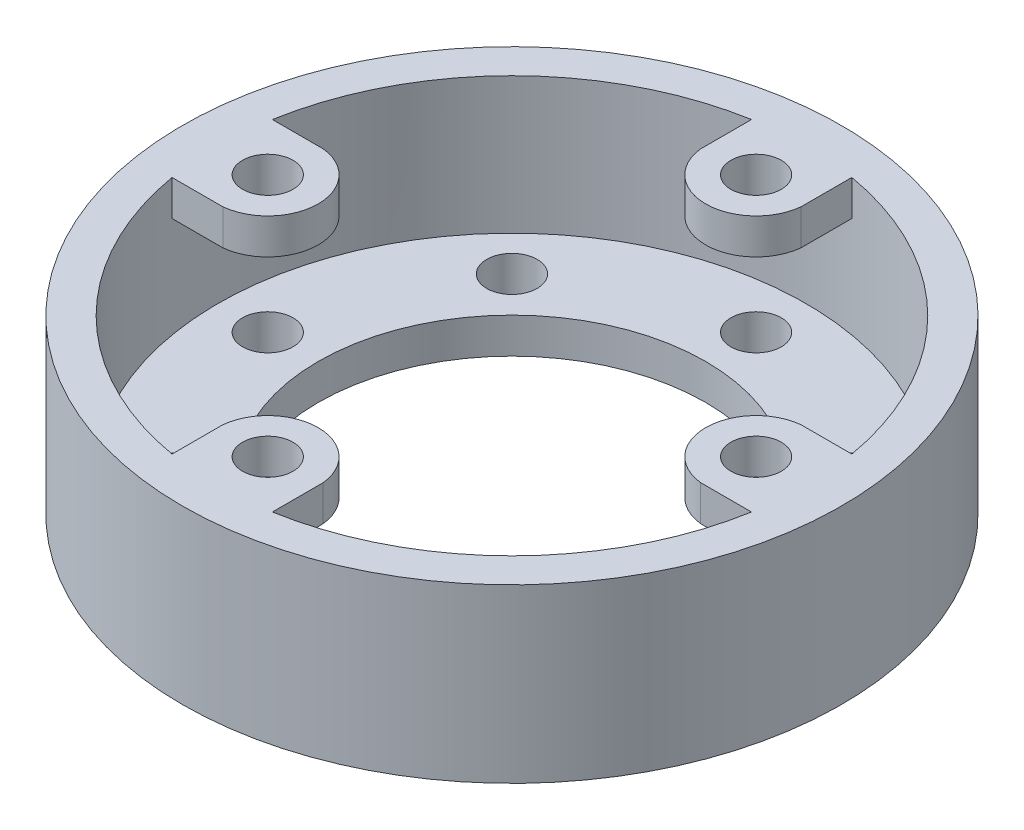
ISO-10303-21;
HEADER;
FILE_DESCRIPTION(('STEP AP214'),'2;1');
FILE_NAME('part.step','',(''),(''),'','','');
FILE_SCHEMA(('AUTOMOTIVE_DESIGN { 1 0 10303 214 1 1 1 1 }'));
ENDSEC;
DATA;
#1=APPLICATION_CONTEXT('core data for automotive mechanical design processes');
#2=APPLICATION_PROTOCOL_DEFINITION('international standard','automotive_design',2000,#1);
#3=PRODUCT_CONTEXT('',#1,'mechanical');
#4=PRODUCT('Part','Part','',(#3));
#5=PRODUCT_RELATED_PRODUCT_CATEGORY('part','',(#4));
#6=PRODUCT_DEFINITION_FORMATION('','',#4);
#7=PRODUCT_DEFINITION_CONTEXT('part definition',#1,'design');
#8=PRODUCT_DEFINITION('design','',#6,#7);
#9=PRODUCT_DEFINITION_SHAPE('','',#8);
#10=(LENGTH_UNIT() NAMED_UNIT(*) SI_UNIT(.MILLI.,.METRE.));
#11=(NAMED_UNIT(*) PLANE_ANGLE_UNIT() SI_UNIT($,.RADIAN.));
#12=(NAMED_UNIT(*) SI_UNIT($,.STERADIAN.) SOLID_ANGLE_UNIT());
#13=UNCERTAINTY_MEASURE_WITH_UNIT(LENGTH_MEASURE(1.E-05),#10,'distance_accuracy_value','');
#14=(GEOMETRIC_REPRESENTATION_CONTEXT(3) GLOBAL_UNCERTAINTY_ASSIGNED_CONTEXT((#13)) GLOBAL_UNIT_ASSIGNED_CONTEXT((#10,
#11,#12)) REPRESENTATION_CONTEXT('',''));
#15=CARTESIAN_POINT('',(0.,0.,0.));
#16=DIRECTION('',(0.,0.,1.));
#17=DIRECTION('',(1.,0.,0.));
#18=AXIS2_PLACEMENT_3D('',#15,#16,#17);
#19=CARTESIAN_POINT('',(0.,15.,0.));
#20=DIRECTION('',(0.,-1.,0.));
#21=DIRECTION('',(0.,0.,-1.));
#22=AXIS2_PLACEMENT_3D('',#19,#20,#21);
#23=CYLINDRICAL_SURFACE('',#22,25.65);
#24=CARTESIAN_POINT('',(0.,3.1,0.));
#25=DIRECTION('',(0.,1.,0.));
#26=DIRECTION('',(0.,0.,1.));
#27=AXIS2_PLACEMENT_3D('',#24,#25,#26);
#28=CIRCLE('',#27,25.65);
#29=CARTESIAN_POINT('',(0.,3.1,25.65));
#30=VERTEX_POINT('',#29);
#31=EDGE_CURVE('E384',#30,#30,#28,.F.);
#32=ORIENTED_EDGE('',*,*,#31,.T.);
#33=EDGE_LOOP('',(#32));
#34=FACE_BOUND('',#33,.T.);
#35=CARTESIAN_POINT('',(0.,15.,0.));
#36=DIRECTION('',(0.,1.,0.));
#37=DIRECTION('',(0.,0.,1.));
#38=AXIS2_PLACEMENT_3D('',#35,#36,#37);
#39=CIRCLE('',#38,25.65);
#40=CARTESIAN_POINT('',(-4.37646729943861,15.,-25.2738804693095));
#41=VERTEX_POINT('',#40);
#42=CARTESIAN_POINT('',(-25.2738804693095,15.,-4.3764672994386));
#43=VERTEX_POINT('',#42);
#44=EDGE_CURVE('E241',#41,#43,#39,.T.);
#45=ORIENTED_EDGE('',*,*,#44,.T.);
#46=DIRECTION('',(0.,-1.,0.));
#47=VECTOR('',#46,1.);
#48=CARTESIAN_POINT('',(-25.2738804693095,15.,-4.3764672994386));
#49=LINE('',#48,#47);
#50=CARTESIAN_POINT('',(-25.2738804693095,11.9,-4.3764672994386));
#51=VERTEX_POINT('',#50);
#52=EDGE_CURVE('E137',#43,#51,#49,.T.);
#53=ORIENTED_EDGE('',*,*,#52,.T.);
#54=CARTESIAN_POINT('',(0.,11.9,0.));
#55=DIRECTION('',(0.,1.,0.));
#56=DIRECTION('',(0.,0.,1.));
#57=AXIS2_PLACEMENT_3D('',#54,#55,#56);
#58=CIRCLE('',#57,25.65);
#59=CARTESIAN_POINT('',(-25.2738804693095,11.9,4.3764672994386));
#60=VERTEX_POINT('',#59);
#61=EDGE_CURVE('E132',#51,#60,#58,.T.);
#62=ORIENTED_EDGE('',*,*,#61,.T.);
#63=DIRECTION('',(0.,-1.,0.));
#64=VECTOR('',#63,1.);
#65=CARTESIAN_POINT('',(-25.2738804693095,15.,4.3764672994386));
#66=LINE('',#65,#64);
#67=CARTESIAN_POINT('',(-25.2738804693095,15.,4.3764672994386));
#68=VERTEX_POINT('',#67);
#69=EDGE_CURVE('E245',#68,#60,#66,.T.);
#70=ORIENTED_EDGE('',*,*,#69,.F.);
#71=CARTESIAN_POINT('',(-4.37646729943859,15.,25.2738804693095));
#72=VERTEX_POINT('',#71);
#73=EDGE_CURVE('E229',#68,#72,#39,.T.);
#74=ORIENTED_EDGE('',*,*,#73,.T.);
#75=DIRECTION('',(0.,-1.,0.));
#76=VECTOR('',#75,1.);
#77=CARTESIAN_POINT('',(-4.37646729943859,15.,25.2738804693095));
#78=LINE('',#77,#76);
#79=CARTESIAN_POINT('',(-4.37646729943859,11.9,25.2738804693095));
#80=VERTEX_POINT('',#79);
#81=EDGE_CURVE('E308',#72,#80,#78,.T.);
#82=ORIENTED_EDGE('',*,*,#81,.T.);
#83=CARTESIAN_POINT('',(0.,11.9,0.));
#84=DIRECTION('',(0.,1.,0.));
#85=DIRECTION('',(0.,0.,1.));
#86=AXIS2_PLACEMENT_3D('',#83,#84,#85);
#87=CIRCLE('',#86,25.65);
#88=CARTESIAN_POINT('',(4.37646729943861,11.9,25.2738804693095));
#89=VERTEX_POINT('',#88);
#90=EDGE_CURVE('E295',#80,#89,#87,.T.);
#91=ORIENTED_EDGE('',*,*,#90,.T.);
#92=DIRECTION('',(0.,-1.,0.));
#93=VECTOR('',#92,1.);
#94=CARTESIAN_POINT('',(4.37646729943861,15.,25.2738804693095));
#95=LINE('',#94,#93);
#96=CARTESIAN_POINT('',(4.37646729943861,15.,25.2738804693095));
#97=VERTEX_POINT('',#96);
#98=EDGE_CURVE('E305',#97,#89,#95,.T.);
#99=ORIENTED_EDGE('',*,*,#98,.F.);
#100=CARTESIAN_POINT('',(25.2738804693095,15.,4.37646729943859));
#101=VERTEX_POINT('',#100);
#102=EDGE_CURVE('E242',#97,#101,#39,.T.);
#103=ORIENTED_EDGE('',*,*,#102,.T.);
#104=DIRECTION('',(0.,-1.,0.));
#105=VECTOR('',#104,1.);
#106=CARTESIAN_POINT('',(25.2738804693095,15.,4.37646729943859));
#107=LINE('',#106,#105);
#108=CARTESIAN_POINT('',(25.2738804693095,11.9,4.37646729943859));
#109=VERTEX_POINT('',#108);
#110=EDGE_CURVE('E377',#101,#109,#107,.T.);
#111=ORIENTED_EDGE('',*,*,#110,.T.);
#112=CARTESIAN_POINT('',(0.,11.9,0.));
#113=DIRECTION('',(0.,1.,0.));
#114=DIRECTION('',(0.,0.,1.));
#115=AXIS2_PLACEMENT_3D('',#112,#113,#114);
#116=CIRCLE('',#115,25.65);
#117=CARTESIAN_POINT('',(25.2738804693095,11.9,-4.37646729943861));
#118=VERTEX_POINT('',#117);
#119=EDGE_CURVE('E364',#109,#118,#116,.T.);
#120=ORIENTED_EDGE('',*,*,#119,.T.);
#121=DIRECTION('',(0.,-1.,0.));
#122=VECTOR('',#121,1.);
#123=CARTESIAN_POINT('',(25.2738804693095,15.,-4.37646729943861));
#124=LINE('',#123,#122);
#125=CARTESIAN_POINT('',(25.2738804693095,15.,-4.37646729943861));
#126=VERTEX_POINT('',#125);
#127=EDGE_CURVE('E374',#126,#118,#124,.T.);
#128=ORIENTED_EDGE('',*,*,#127,.F.);
#129=CARTESIAN_POINT('',(4.37646729943859,15.,-25.2738804693095));
#130=VERTEX_POINT('',#129);
#131=EDGE_CURVE('E244',#126,#130,#39,.T.);
#132=ORIENTED_EDGE('',*,*,#131,.T.);
#133=DIRECTION('',(0.,-1.,0.));
#134=VECTOR('',#133,1.);
#135=CARTESIAN_POINT('',(4.37646729943859,15.,-25.2738804693095));
#136=LINE('',#135,#134);
#137=CARTESIAN_POINT('',(4.37646729943859,11.9,-25.2738804693095));
#138=VERTEX_POINT('',#137);
#139=EDGE_CURVE('E343',#130,#138,#136,.T.);
#140=ORIENTED_EDGE('',*,*,#139,.T.);
#141=CARTESIAN_POINT('',(0.,11.9,0.));
#142=DIRECTION('',(0.,1.,0.));
#143=DIRECTION('',(0.,0.,1.));
#144=AXIS2_PLACEMENT_3D('',#141,#142,#143);
#145=CIRCLE('',#144,25.65);
#146=CARTESIAN_POINT('',(-4.37646729943861,11.9,-25.2738804693095));
#147=VERTEX_POINT('',#146);
#148=EDGE_CURVE('E330',#138,#147,#145,.T.);
#149=ORIENTED_EDGE('',*,*,#148,.T.);
#150=DIRECTION('',(0.,-1.,0.));
#151=VECTOR('',#150,1.);
#152=CARTESIAN_POINT('',(-4.37646729943861,15.,-25.2738804693095));
#153=LINE('',#152,#151);
#154=EDGE_CURVE('E340',#41,#147,#153,.T.);
#155=ORIENTED_EDGE('',*,*,#154,.F.);
#156=EDGE_LOOP('',(#45,#53,#62,#70,#74,#82,#91,#99,#103,#111,#120,#128,#132,#140,#149,#155));
#157=FACE_BOUND('',#156,.T.);
#158=ADVANCED_FACE('F117',(#34,#157),#23,.F.);
#159=CARTESIAN_POINT('',(0.,3.1,0.));
#160=DIRECTION('',(0.,1.,0.));
#161=DIRECTION('',(0.,0.,1.));
#162=AXIS2_PLACEMENT_3D('',#159,#160,#161);
#163=PLANE('',#162);
#164=CARTESIAN_POINT('',(-15.0613744392735,3.1,-15.0613744392735));
#165=DIRECTION('',(0.,1.,0.));
#166=DIRECTION('',(0.,0.,1.));
#167=AXIS2_PLACEMENT_3D('',#164,#165,#166);
#168=CIRCLE('',#167,2.2);
#169=CARTESIAN_POINT('',(-15.0613744392735,3.1,-12.8613744392735));
#170=VERTEX_POINT('',#169);
#171=EDGE_CURVE('E396',#170,#170,#168,.T.);
#172=ORIENTED_EDGE('',*,*,#171,.F.);
#173=EDGE_LOOP('',(#172));
#174=FACE_BOUND('',#173,.T.);
#175=CARTESIAN_POINT('',(15.0613744392735,3.1,-15.0613744392735));
#176=DIRECTION('',(0.,1.,0.));
#177=DIRECTION('',(0.,0.,1.));
#178=AXIS2_PLACEMENT_3D('',#175,#176,#177);
#179=CIRCLE('',#178,2.2);
#180=CARTESIAN_POINT('',(15.0613744392735,3.1,-12.8613744392735));
#181=VERTEX_POINT('',#180);
#182=EDGE_CURVE('E408',#181,#181,#179,.T.);
#183=ORIENTED_EDGE('',*,*,#182,.F.);
#184=EDGE_LOOP('',(#183));
#185=FACE_BOUND('',#184,.T.);
#186=CARTESIAN_POINT('',(15.0613744392735,3.1,15.0613744392735));
#187=DIRECTION('',(0.,1.,0.));
#188=DIRECTION('',(0.,0.,1.));
#189=AXIS2_PLACEMENT_3D('',#186,#187,#188);
#190=CIRCLE('',#189,2.2);
#191=CARTESIAN_POINT('',(15.0613744392735,3.1,17.2613744392735));
#192=VERTEX_POINT('',#191);
#193=EDGE_CURVE('E420',#192,#192,#190,.T.);
#194=ORIENTED_EDGE('',*,*,#193,.F.);
#195=EDGE_LOOP('',(#194));
#196=FACE_BOUND('',#195,.T.);
#197=CARTESIAN_POINT('',(-15.0613744392735,3.1,15.0613744392735));
#198=DIRECTION('',(0.,1.,0.));
#199=DIRECTION('',(0.,0.,1.));
#200=AXIS2_PLACEMENT_3D('',#197,#198,#199);
#201=CIRCLE('',#200,2.2);
#202=CARTESIAN_POINT('',(-15.0613744392735,3.1,17.2613744392735));
#203=VERTEX_POINT('',#202);
#204=EDGE_CURVE('E432',#203,#203,#201,.T.);
#205=ORIENTED_EDGE('',*,*,#204,.F.);
#206=EDGE_LOOP('',(#205));
#207=FACE_BOUND('',#206,.T.);
#208=ORIENTED_EDGE('',*,*,#31,.F.);
#209=EDGE_LOOP('',(#208));
#210=FACE_BOUND('',#209,.T.);
#211=CARTESIAN_POINT('',(0.,3.1,0.));
#212=DIRECTION('',(0.,1.,0.));
#213=DIRECTION('',(0.,0.,1.));
#214=AXIS2_PLACEMENT_3D('',#211,#212,#213);
#215=CIRCLE('',#214,16.9);
#216=CARTESIAN_POINT('',(0.,3.1,16.9));
#217=VERTEX_POINT('',#216);
#218=EDGE_CURVE('E12',#217,#217,#215,.T.);
#219=ORIENTED_EDGE('',*,*,#218,.F.);
#220=EDGE_LOOP('',(#219));
#221=FACE_BOUND('',#220,.T.);
#222=CARTESIAN_POINT('',(0.,3.1,21.3));
#223=DIRECTION('',(0.,1.,0.));
#224=DIRECTION('',(0.,0.,1.));
#225=AXIS2_PLACEMENT_3D('',#222,#223,#224);
#226=CIRCLE('',#225,2.2);
#227=CARTESIAN_POINT('',(0.,3.1,23.5));
#228=VERTEX_POINT('',#227);
#229=EDGE_CURVE('E426',#228,#228,#226,.T.);
#230=ORIENTED_EDGE('',*,*,#229,.F.);
#231=EDGE_LOOP('',(#230));
#232=FACE_BOUND('',#231,.T.);
#233=CARTESIAN_POINT('',(21.3,3.1,0.));
#234=DIRECTION('',(0.,1.,0.));
#235=DIRECTION('',(0.,0.,1.));
#236=AXIS2_PLACEMENT_3D('',#233,#234,#235);
#237=CIRCLE('',#236,2.2);
#238=CARTESIAN_POINT('',(21.3,3.1,2.2));
#239=VERTEX_POINT('',#238);
#240=EDGE_CURVE('E414',#239,#239,#237,.T.);
#241=ORIENTED_EDGE('',*,*,#240,.F.);
#242=EDGE_LOOP('',(#241));
#243=FACE_BOUND('',#242,.T.);
#244=CARTESIAN_POINT('',(0.,3.1,-21.3));
#245=DIRECTION('',(0.,1.,0.));
#246=DIRECTION('',(0.,0.,1.));
#247=AXIS2_PLACEMENT_3D('',#244,#245,#246);
#248=CIRCLE('',#247,2.2);
#249=CARTESIAN_POINT('',(0.,3.1,-19.1));
#250=VERTEX_POINT('',#249);
#251=EDGE_CURVE('E402',#250,#250,#248,.T.);
#252=ORIENTED_EDGE('',*,*,#251,.F.);
#253=EDGE_LOOP('',(#252));
#254=FACE_BOUND('',#253,.T.);
#255=CARTESIAN_POINT('',(-21.3,3.1,0.));
#256=DIRECTION('',(0.,1.,0.));
#257=DIRECTION('',(0.,0.,1.));
#258=AXIS2_PLACEMENT_3D('',#255,#256,#257);
#259=CIRCLE('',#258,2.2);
#260=CARTESIAN_POINT('',(-21.3,3.1,2.20000000000001));
#261=VERTEX_POINT('',#260);
#262=EDGE_CURVE('E390',#261,#261,#259,.T.);
#263=ORIENTED_EDGE('',*,*,#262,.F.);
#264=EDGE_LOOP('',(#263));
#265=FACE_BOUND('',#264,.T.);
#266=ADVANCED_FACE('F456',(#174,#185,#196,#207,#210,#221,#232,#243,#254,#265),#163,.T.);
#267=CARTESIAN_POINT('',(0.,0.,0.));
#268=DIRECTION('',(0.,1.,0.));
#269=DIRECTION('',(0.,0.,1.));
#270=AXIS2_PLACEMENT_3D('',#267,#268,#269);
#271=PLANE('',#270);
#272=CARTESIAN_POINT('',(0.,0.,0.));
#273=DIRECTION('',(0.,1.,0.));
#274=DIRECTION('',(0.,0.,1.));
#275=AXIS2_PLACEMENT_3D('',#272,#273,#274);
#276=CIRCLE('',#275,16.9);
#277=CARTESIAN_POINT('',(0.,0.,16.9));
#278=VERTEX_POINT('',#277);
#279=EDGE_CURVE('E121',#278,#278,#276,.T.);
#280=ORIENTED_EDGE('',*,*,#279,.T.);
#281=EDGE_LOOP('',(#280));
#282=FACE_BOUND('',#281,.T.);
#283=CARTESIAN_POINT('',(-15.0613744392735,0.,15.0613744392735));
#284=DIRECTION('',(0.,1.,0.));
#285=DIRECTION('',(0.,0.,1.));
#286=AXIS2_PLACEMENT_3D('',#283,#284,#285);
#287=CIRCLE('',#286,2.2);
#288=CARTESIAN_POINT('',(-15.0613744392735,0.,17.2613744392735));
#289=VERTEX_POINT('',#288);
#290=EDGE_CURVE('E429',#289,#289,#287,.T.);
#291=ORIENTED_EDGE('',*,*,#290,.T.);
#292=EDGE_LOOP('',(#291));
#293=FACE_BOUND('',#292,.T.);
#294=CARTESIAN_POINT('',(0.,0.,21.3));
#295=DIRECTION('',(0.,1.,0.));
#296=DIRECTION('',(0.,0.,1.));
#297=AXIS2_PLACEMENT_3D('',#294,#295,#296);
#298=CIRCLE('',#297,2.2);
#299=CARTESIAN_POINT('',(0.,0.,23.5));
#300=VERTEX_POINT('',#299);
#301=EDGE_CURVE('E423',#300,#300,#298,.T.);
#302=ORIENTED_EDGE('',*,*,#301,.T.);
#303=EDGE_LOOP('',(#302));
#304=FACE_BOUND('',#303,.T.);
#305=CARTESIAN_POINT('',(15.0613744392735,0.,15.0613744392735));
#306=DIRECTION('',(0.,1.,0.));
#307=DIRECTION('',(0.,0.,1.));
#308=AXIS2_PLACEMENT_3D('',#305,#306,#307);
#309=CIRCLE('',#308,2.2);
#310=CARTESIAN_POINT('',(15.0613744392735,0.,17.2613744392735));
#311=VERTEX_POINT('',#310);
#312=EDGE_CURVE('E417',#311,#311,#309,.T.);
#313=ORIENTED_EDGE('',*,*,#312,.T.);
#314=EDGE_LOOP('',(#313));
#315=FACE_BOUND('',#314,.T.);
#316=CARTESIAN_POINT('',(21.3,0.,0.));
#317=DIRECTION('',(0.,1.,0.));
#318=DIRECTION('',(0.,0.,1.));
#319=AXIS2_PLACEMENT_3D('',#316,#317,#318);
#320=CIRCLE('',#319,2.2);
#321=CARTESIAN_POINT('',(21.3,0.,2.2));
#322=VERTEX_POINT('',#321);
#323=EDGE_CURVE('E411',#322,#322,#320,.T.);
#324=ORIENTED_EDGE('',*,*,#323,.T.);
#325=EDGE_LOOP('',(#324));
#326=FACE_BOUND('',#325,.T.);
#327=CARTESIAN_POINT('',(15.0613744392735,0.,-15.0613744392735));
#328=DIRECTION('',(0.,1.,0.));
#329=DIRECTION('',(0.,0.,1.));
#330=AXIS2_PLACEMENT_3D('',#327,#328,#329);
#331=CIRCLE('',#330,2.2);
#332=CARTESIAN_POINT('',(15.0613744392735,0.,-12.8613744392735));
#333=VERTEX_POINT('',#332);
#334=EDGE_CURVE('E405',#333,#333,#331,.T.);
#335=ORIENTED_EDGE('',*,*,#334,.T.);
#336=EDGE_LOOP('',(#335));
#337=FACE_BOUND('',#336,.T.);
#338=CARTESIAN_POINT('',(0.,0.,-21.3));
#339=DIRECTION('',(0.,1.,0.));
#340=DIRECTION('',(0.,0.,1.));
#341=AXIS2_PLACEMENT_3D('',#338,#339,#340);
#342=CIRCLE('',#341,2.2);
#343=CARTESIAN_POINT('',(0.,0.,-19.1));
#344=VERTEX_POINT('',#343);
#345=EDGE_CURVE('E399',#344,#344,#342,.T.);
#346=ORIENTED_EDGE('',*,*,#345,.T.);
#347=EDGE_LOOP('',(#346));
#348=FACE_BOUND('',#347,.T.);
#349=CARTESIAN_POINT('',(-15.0613744392735,0.,-15.0613744392735));
#350=DIRECTION('',(0.,1.,0.));
#351=DIRECTION('',(0.,0.,1.));
#352=AXIS2_PLACEMENT_3D('',#349,#350,#351);
#353=CIRCLE('',#352,2.2);
#354=CARTESIAN_POINT('',(-15.0613744392735,0.,-12.8613744392735));
#355=VERTEX_POINT('',#354);
#356=EDGE_CURVE('E393',#355,#355,#353,.T.);
#357=ORIENTED_EDGE('',*,*,#356,.T.);
#358=EDGE_LOOP('',(#357));
#359=FACE_BOUND('',#358,.T.);
#360=CARTESIAN_POINT('',(-21.3,0.,0.));
#361=DIRECTION('',(0.,1.,0.));
#362=DIRECTION('',(0.,0.,1.));
#363=AXIS2_PLACEMENT_3D('',#360,#361,#362);
#364=CIRCLE('',#363,2.2);
#365=CARTESIAN_POINT('',(-21.3,0.,2.20000000000001));
#366=VERTEX_POINT('',#365);
#367=EDGE_CURVE('E389',#366,#366,#364,.T.);
#368=ORIENTED_EDGE('',*,*,#367,.T.);
#369=EDGE_LOOP('',(#368));
#370=FACE_BOUND('',#369,.T.);
#371=CARTESIAN_POINT('',(0.,0.,0.));
#372=DIRECTION('',(0.,1.,0.));
#373=DIRECTION('',(0.,0.,1.));
#374=AXIS2_PLACEMENT_3D('',#371,#372,#373);
#375=CIRCLE('',#374,28.75);
#376=CARTESIAN_POINT('',(0.,0.,28.75));
#377=VERTEX_POINT('',#376);
#378=EDGE_CURVE('E380',#377,#377,#375,.T.);
#379=ORIENTED_EDGE('',*,*,#378,.F.);
#380=EDGE_LOOP('',(#379));
#381=FACE_BOUND('',#380,.T.);
#382=ADVANCED_FACE('F119',(#282,#293,#304,#315,#326,#337,#348,#359,#370,#381),#271,.F.);
#383=CARTESIAN_POINT('',(0.,3.1,0.));
#384=DIRECTION('',(0.,-1.,0.));
#385=DIRECTION('',(0.,0.,-1.));
#386=AXIS2_PLACEMENT_3D('',#383,#384,#385);
#387=CYLINDRICAL_SURFACE('',#386,16.9);
#388=ORIENTED_EDGE('',*,*,#218,.T.);
#389=EDGE_LOOP('',(#388));
#390=FACE_BOUND('',#389,.T.);
#391=ORIENTED_EDGE('',*,*,#279,.F.);
#392=EDGE_LOOP('',(#391));
#393=FACE_BOUND('',#392,.T.);
#394=ADVANCED_FACE('F443',(#390,#393),#387,.F.);
#395=CARTESIAN_POINT('',(-15.0613744392735,3.1,15.0613744392735));
#396=DIRECTION('',(0.,-1.,0.));
#397=DIRECTION('',(0.,0.,-1.));
#398=AXIS2_PLACEMENT_3D('',#395,#396,#397);
#399=CYLINDRICAL_SURFACE('',#398,2.2);
#400=ORIENTED_EDGE('',*,*,#204,.T.);
#401=EDGE_LOOP('',(#400));
#402=FACE_BOUND('',#401,.T.);
#403=ORIENTED_EDGE('',*,*,#290,.F.);
#404=EDGE_LOOP('',(#403));
#405=FACE_BOUND('',#404,.T.);
#406=ADVANCED_FACE('F440',(#402,#405),#399,.F.);
#407=CARTESIAN_POINT('',(0.,3.1,21.3));
#408=DIRECTION('',(0.,-1.,0.));
#409=DIRECTION('',(0.,0.,-1.));
#410=AXIS2_PLACEMENT_3D('',#407,#408,#409);
#411=CYLINDRICAL_SURFACE('',#410,2.2);
#412=ORIENTED_EDGE('',*,*,#229,.T.);
#413=EDGE_LOOP('',(#412));
#414=FACE_BOUND('',#413,.T.);
#415=ORIENTED_EDGE('',*,*,#301,.F.);
#416=EDGE_LOOP('',(#415));
#417=FACE_BOUND('',#416,.T.);
#418=ADVANCED_FACE('F442',(#414,#417),#411,.F.);
#419=CARTESIAN_POINT('',(15.0613744392735,3.1,15.0613744392735));
#420=DIRECTION('',(0.,-1.,0.));
#421=DIRECTION('',(0.,0.,-1.));
#422=AXIS2_PLACEMENT_3D('',#419,#420,#421);
#423=CYLINDRICAL_SURFACE('',#422,2.2);
#424=ORIENTED_EDGE('',*,*,#193,.T.);
#425=EDGE_LOOP('',(#424));
#426=FACE_BOUND('',#425,.T.);
#427=ORIENTED_EDGE('',*,*,#312,.F.);
#428=EDGE_LOOP('',(#427));
#429=FACE_BOUND('',#428,.T.);
#430=ADVANCED_FACE('F450',(#426,#429),#423,.F.);
#431=CARTESIAN_POINT('',(21.3,3.1,0.));
#432=DIRECTION('',(0.,-1.,0.));
#433=DIRECTION('',(0.,0.,-1.));
#434=AXIS2_PLACEMENT_3D('',#431,#432,#433);
#435=CYLINDRICAL_SURFACE('',#434,2.2);
#436=ORIENTED_EDGE('',*,*,#240,.T.);
#437=EDGE_LOOP('',(#436));
#438=FACE_BOUND('',#437,.T.);
#439=ORIENTED_EDGE('',*,*,#323,.F.);
#440=EDGE_LOOP('',(#439));
#441=FACE_BOUND('',#440,.T.);
#442=ADVANCED_FACE('F490',(#438,#441),#435,.F.);
#443=CARTESIAN_POINT('',(15.0613744392735,3.1,-15.0613744392735));
#444=DIRECTION('',(0.,-1.,0.));
#445=DIRECTION('',(0.,0.,-1.));
#446=AXIS2_PLACEMENT_3D('',#443,#444,#445);
#447=CYLINDRICAL_SURFACE('',#446,2.2);
#448=ORIENTED_EDGE('',*,*,#182,.T.);
#449=EDGE_LOOP('',(#448));
#450=FACE_BOUND('',#449,.T.);
#451=ORIENTED_EDGE('',*,*,#334,.F.);
#452=EDGE_LOOP('',(#451));
#453=FACE_BOUND('',#452,.T.);
#454=ADVANCED_FACE('F486',(#450,#453),#447,.F.);
#455=CARTESIAN_POINT('',(0.,3.1,-21.3));
#456=DIRECTION('',(0.,-1.,0.));
#457=DIRECTION('',(0.,0.,-1.));
#458=AXIS2_PLACEMENT_3D('',#455,#456,#457);
#459=CYLINDRICAL_SURFACE('',#458,2.2);
#460=ORIENTED_EDGE('',*,*,#251,.T.);
#461=EDGE_LOOP('',(#460));
#462=FACE_BOUND('',#461,.T.);
#463=ORIENTED_EDGE('',*,*,#345,.F.);
#464=EDGE_LOOP('',(#463));
#465=FACE_BOUND('',#464,.T.);
#466=ADVANCED_FACE('F482',(#462,#465),#459,.F.);
#467=CARTESIAN_POINT('',(-15.0613744392735,3.1,-15.0613744392735));
#468=DIRECTION('',(0.,-1.,0.));
#469=DIRECTION('',(0.,0.,-1.));
#470=AXIS2_PLACEMENT_3D('',#467,#468,#469);
#471=CYLINDRICAL_SURFACE('',#470,2.2);
#472=ORIENTED_EDGE('',*,*,#171,.T.);
#473=EDGE_LOOP('',(#472));
#474=FACE_BOUND('',#473,.T.);
#475=ORIENTED_EDGE('',*,*,#356,.F.);
#476=EDGE_LOOP('',(#475));
#477=FACE_BOUND('',#476,.T.);
#478=ADVANCED_FACE('F478',(#474,#477),#471,.F.);
#479=CARTESIAN_POINT('',(-21.3,3.1,0.));
#480=DIRECTION('',(0.,-1.,0.));
#481=DIRECTION('',(0.,0.,-1.));
#482=AXIS2_PLACEMENT_3D('',#479,#480,#481);
#483=CYLINDRICAL_SURFACE('',#482,2.2);
#484=ORIENTED_EDGE('',*,*,#262,.T.);
#485=EDGE_LOOP('',(#484));
#486=FACE_BOUND('',#485,.T.);
#487=ORIENTED_EDGE('',*,*,#367,.F.);
#488=EDGE_LOOP('',(#487));
#489=FACE_BOUND('',#488,.T.);
#490=ADVANCED_FACE('F470',(#486,#489),#483,.F.);
#491=CARTESIAN_POINT('',(0.,15.,0.));
#492=DIRECTION('',(0.,1.,0.));
#493=DIRECTION('',(0.,0.,1.));
#494=AXIS2_PLACEMENT_3D('',#491,#492,#493);
#495=PLANE('',#494);
#496=CARTESIAN_POINT('',(0.,15.,0.));
#497=DIRECTION('',(0.,1.,0.));
#498=DIRECTION('',(0.,0.,1.));
#499=AXIS2_PLACEMENT_3D('',#496,#497,#498);
#500=CIRCLE('',#499,28.75);
#501=CARTESIAN_POINT('',(0.,15.,28.75));
#502=VERTEX_POINT('',#501);
#503=EDGE_CURVE('E381',#502,#502,#500,.T.);
#504=ORIENTED_EDGE('',*,*,#503,.T.);
#505=EDGE_LOOP('',(#504));
#506=FACE_BOUND('',#505,.T.);
#507=ORIENTED_EDGE('',*,*,#131,.F.);
#508=DIRECTION('',(1.,0.,0.));
#509=VECTOR('',#508,1.);
#510=CARTESIAN_POINT('',(0.,15.,-4.3764672994386));
#511=LINE('',#510,#509);
#512=CARTESIAN_POINT('',(20.8455399061033,15.,-4.37646729943861));
#513=VERTEX_POINT('',#512);
#514=EDGE_CURVE('E353',#513,#126,#511,.T.);
#515=ORIENTED_EDGE('',*,*,#514,.F.);
#516=CARTESIAN_POINT('',(21.3,15.,0.));
#517=DIRECTION('',(0.,1.,0.));
#518=DIRECTION('',(0.,0.,1.));
#519=AXIS2_PLACEMENT_3D('',#516,#517,#518);
#520=CIRCLE('',#519,4.4);
#521=CARTESIAN_POINT('',(20.8455399061033,15.,4.37646729943859));
#522=VERTEX_POINT('',#521);
#523=EDGE_CURVE('E355',#522,#513,#520,.F.);
#524=ORIENTED_EDGE('',*,*,#523,.F.);
#525=DIRECTION('',(1.,0.,0.));
#526=VECTOR('',#525,1.);
#527=CARTESIAN_POINT('',(0.,15.,4.3764672994386));
#528=LINE('',#527,#526);
#529=EDGE_CURVE('E349',#522,#101,#528,.T.);
#530=ORIENTED_EDGE('',*,*,#529,.T.);
#531=ORIENTED_EDGE('',*,*,#102,.F.);
#532=DIRECTION('',(0.,0.,1.));
#533=VECTOR('',#532,1.);
#534=CARTESIAN_POINT('',(4.3764672994386,15.,0.));
#535=LINE('',#534,#533);
#536=CARTESIAN_POINT('',(4.37646729943861,15.,20.8455399061033));
#537=VERTEX_POINT('',#536);
#538=EDGE_CURVE('E283',#537,#97,#535,.T.);
#539=ORIENTED_EDGE('',*,*,#538,.F.);
#540=CARTESIAN_POINT('',(0.,15.,21.3));
#541=DIRECTION('',(0.,1.,0.));
#542=DIRECTION('',(0.,0.,1.));
#543=AXIS2_PLACEMENT_3D('',#540,#541,#542);
#544=CIRCLE('',#543,4.4);
#545=CARTESIAN_POINT('',(-4.37646729943859,15.,20.8455399061033));
#546=VERTEX_POINT('',#545);
#547=EDGE_CURVE('E286',#546,#537,#544,.F.);
#548=ORIENTED_EDGE('',*,*,#547,.F.);
#549=DIRECTION('',(0.,0.,1.));
#550=VECTOR('',#549,1.);
#551=CARTESIAN_POINT('',(-4.3764672994386,15.,0.));
#552=LINE('',#551,#550);
#553=EDGE_CURVE('E239',#546,#72,#552,.T.);
#554=ORIENTED_EDGE('',*,*,#553,.T.);
#555=ORIENTED_EDGE('',*,*,#73,.F.);
#556=DIRECTION('',(-1.,0.,0.));
#557=VECTOR('',#556,1.);
#558=CARTESIAN_POINT('',(0.,15.,4.3764672994386));
#559=LINE('',#558,#557);
#560=CARTESIAN_POINT('',(-20.8455399061033,15.,4.3764672994386));
#561=VERTEX_POINT('',#560);
#562=EDGE_CURVE('E235',#561,#68,#559,.T.);
#563=ORIENTED_EDGE('',*,*,#562,.F.);
#564=CARTESIAN_POINT('',(-21.3,15.,0.));
#565=DIRECTION('',(0.,1.,0.));
#566=DIRECTION('',(0.,0.,1.));
#567=AXIS2_PLACEMENT_3D('',#564,#565,#566);
#568=CIRCLE('',#567,4.4);
#569=CARTESIAN_POINT('',(-20.8455399061033,15.,-4.3764672994386));
#570=VERTEX_POINT('',#569);
#571=EDGE_CURVE('E252',#570,#561,#568,.F.);
#572=ORIENTED_EDGE('',*,*,#571,.F.);
#573=DIRECTION('',(-1.,0.,0.));
#574=VECTOR('',#573,1.);
#575=CARTESIAN_POINT('',(0.,15.,-4.3764672994386));
#576=LINE('',#575,#574);
#577=EDGE_CURVE('E253',#570,#43,#576,.T.);
#578=ORIENTED_EDGE('',*,*,#577,.T.);
#579=ORIENTED_EDGE('',*,*,#44,.F.);
#580=DIRECTION('',(0.,0.,-1.));
#581=VECTOR('',#580,1.);
#582=CARTESIAN_POINT('',(-4.37646729943859,15.,0.));
#583=LINE('',#582,#581);
#584=CARTESIAN_POINT('',(-4.37646729943861,15.,-20.8455399061033));
#585=VERTEX_POINT('',#584);
#586=EDGE_CURVE('E318',#585,#41,#583,.T.);
#587=ORIENTED_EDGE('',*,*,#586,.F.);
#588=CARTESIAN_POINT('',(0.,15.,-21.3));
#589=DIRECTION('',(0.,1.,0.));
#590=DIRECTION('',(0.,0.,1.));
#591=AXIS2_PLACEMENT_3D('',#588,#589,#590);
#592=CIRCLE('',#591,4.4);
#593=CARTESIAN_POINT('',(4.37646729943859,15.,-20.8455399061033));
#594=VERTEX_POINT('',#593);
#595=EDGE_CURVE('E321',#594,#585,#592,.F.);
#596=ORIENTED_EDGE('',*,*,#595,.F.);
#597=DIRECTION('',(0.,0.,-1.));
#598=VECTOR('',#597,1.);
#599=CARTESIAN_POINT('',(4.37646729943861,15.,0.));
#600=LINE('',#599,#598);
#601=EDGE_CURVE('E314',#594,#130,#600,.T.);
#602=ORIENTED_EDGE('',*,*,#601,.T.);
#603=EDGE_LOOP('',(#507,#515,#524,#530,#531,#539,#548,#554,#555,#563,#572,#578,#579,#587,#596,#602));
#604=FACE_BOUND('',#603,.T.);
#605=CARTESIAN_POINT('',(21.3,15.,0.));
#606=DIRECTION('',(0.,1.,0.));
#607=DIRECTION('',(0.,0.,1.));
#608=AXIS2_PLACEMENT_3D('',#605,#606,#607);
#609=CIRCLE('',#608,2.20000000000005);
#610=CARTESIAN_POINT('',(21.3,15.,2.20000000000004));
#611=VERTEX_POINT('',#610);
#612=EDGE_CURVE('E346',#611,#611,#609,.T.);
#613=ORIENTED_EDGE('',*,*,#612,.F.);
#614=EDGE_LOOP('',(#613));
#615=FACE_BOUND('',#614,.T.);
#616=CARTESIAN_POINT('',(0.,15.,-21.3));
#617=DIRECTION('',(0.,1.,0.));
#618=DIRECTION('',(0.,0.,1.));
#619=AXIS2_PLACEMENT_3D('',#616,#617,#618);
#620=CIRCLE('',#619,2.20000000000003);
#621=CARTESIAN_POINT('',(0.,15.,-19.1));
#622=VERTEX_POINT('',#621);
#623=EDGE_CURVE('E311',#622,#622,#620,.T.);
#624=ORIENTED_EDGE('',*,*,#623,.F.);
#625=EDGE_LOOP('',(#624));
#626=FACE_BOUND('',#625,.T.);
#627=CARTESIAN_POINT('',(0.,15.,21.3));
#628=DIRECTION('',(0.,1.,0.));
#629=DIRECTION('',(0.,0.,1.));
#630=AXIS2_PLACEMENT_3D('',#627,#628,#629);
#631=CIRCLE('',#630,2.20000000000007);
#632=CARTESIAN_POINT('',(0.,15.,23.5000000000001));
#633=VERTEX_POINT('',#632);
#634=EDGE_CURVE('E278',#633,#633,#631,.T.);
#635=ORIENTED_EDGE('',*,*,#634,.F.);
#636=EDGE_LOOP('',(#635));
#637=FACE_BOUND('',#636,.T.);
#638=CARTESIAN_POINT('',(-21.3,15.,0.));
#639=DIRECTION('',(0.,1.,0.));
#640=DIRECTION('',(0.,0.,1.));
#641=AXIS2_PLACEMENT_3D('',#638,#639,#640);
#642=CIRCLE('',#641,2.2);
#643=CARTESIAN_POINT('',(-21.3,15.,2.20000000000001));
#644=VERTEX_POINT('',#643);
#645=EDGE_CURVE('E258',#644,#644,#642,.T.);
#646=ORIENTED_EDGE('',*,*,#645,.F.);
#647=EDGE_LOOP('',(#646));
#648=FACE_BOUND('',#647,.T.);
#649=ADVANCED_FACE('F231',(#506,#604,#615,#626,#637,#648),#495,.T.);
#650=CARTESIAN_POINT('',(0.,15.,0.));
#651=DIRECTION('',(0.,-1.,0.));
#652=DIRECTION('',(0.,0.,-1.));
#653=AXIS2_PLACEMENT_3D('',#650,#651,#652);
#654=CYLINDRICAL_SURFACE('',#653,28.75);
#655=ORIENTED_EDGE('',*,*,#503,.F.);
#656=EDGE_LOOP('',(#655));
#657=FACE_BOUND('',#656,.T.);
#658=ORIENTED_EDGE('',*,*,#378,.T.);
#659=EDGE_LOOP('',(#658));
#660=FACE_BOUND('',#659,.T.);
#661=ADVANCED_FACE('F469',(#657,#660),#654,.T.);
#662=CARTESIAN_POINT('',(0.,15.,4.3764672994386));
#663=DIRECTION('',(0.,0.,-1.));
#664=DIRECTION('',(-1.,0.,0.));
#665=AXIS2_PLACEMENT_3D('',#662,#663,#664);
#666=PLANE('',#665);
#667=DIRECTION('',(1.,0.,0.));
#668=VECTOR('',#667,1.);
#669=CARTESIAN_POINT('',(0.,11.9,4.3764672994386));
#670=LINE('',#669,#668);
#671=CARTESIAN_POINT('',(20.8455399061033,11.9,4.37646729943859));
#672=VERTEX_POINT('',#671);
#673=EDGE_CURVE('E361',#672,#109,#670,.T.);
#674=ORIENTED_EDGE('',*,*,#673,.T.);
#675=ORIENTED_EDGE('',*,*,#110,.F.);
#676=ORIENTED_EDGE('',*,*,#529,.F.);
#677=DIRECTION('',(0.,-1.,0.));
#678=VECTOR('',#677,1.);
#679=CARTESIAN_POINT('',(20.8455399061033,15.,4.37646729943859));
#680=LINE('',#679,#678);
#681=EDGE_CURVE('E358',#522,#672,#680,.T.);
#682=ORIENTED_EDGE('',*,*,#681,.T.);
#683=EDGE_LOOP('',(#674,#675,#676,#682));
#684=FACE_BOUND('',#683,.T.);
#685=ADVANCED_FACE('F474',(#684),#666,.F.);
#686=CARTESIAN_POINT('',(0.,15.,-4.3764672994386));
#687=DIRECTION('',(0.,0.,-1.));
#688=DIRECTION('',(-1.,0.,0.));
#689=AXIS2_PLACEMENT_3D('',#686,#687,#688);
#690=PLANE('',#689);
#691=DIRECTION('',(1.,0.,0.));
#692=VECTOR('',#691,1.);
#693=CARTESIAN_POINT('',(0.,11.9,-4.3764672994386));
#694=LINE('',#693,#692);
#695=CARTESIAN_POINT('',(20.8455399061033,11.9,-4.37646729943861));
#696=VERTEX_POINT('',#695);
#697=EDGE_CURVE('E367',#696,#118,#694,.T.);
#698=ORIENTED_EDGE('',*,*,#697,.F.);
#699=DIRECTION('',(0.,-1.,0.));
#700=VECTOR('',#699,1.);
#701=CARTESIAN_POINT('',(20.8455399061033,15.,-4.37646729943861));
#702=LINE('',#701,#700);
#703=EDGE_CURVE('E372',#513,#696,#702,.T.);
#704=ORIENTED_EDGE('',*,*,#703,.F.);
#705=ORIENTED_EDGE('',*,*,#514,.T.);
#706=ORIENTED_EDGE('',*,*,#127,.T.);
#707=EDGE_LOOP('',(#698,#704,#705,#706));
#708=FACE_BOUND('',#707,.T.);
#709=ADVANCED_FACE('F597',(#708),#690,.T.);
#710=CARTESIAN_POINT('',(21.3,15.,0.));
#711=DIRECTION('',(0.,-1.,0.));
#712=DIRECTION('',(0.,0.,-1.));
#713=AXIS2_PLACEMENT_3D('',#710,#711,#712);
#714=CYLINDRICAL_SURFACE('',#713,2.20000000000005);
#715=ORIENTED_EDGE('',*,*,#612,.T.);
#716=EDGE_LOOP('',(#715));
#717=FACE_BOUND('',#716,.T.);
#718=CARTESIAN_POINT('',(21.3,11.9,0.));
#719=DIRECTION('',(0.,1.,0.));
#720=DIRECTION('',(0.,0.,1.));
#721=AXIS2_PLACEMENT_3D('',#718,#719,#720);
#722=CIRCLE('',#721,2.20000000000005);
#723=CARTESIAN_POINT('',(21.3,11.9,2.20000000000004));
#724=VERTEX_POINT('',#723);
#725=EDGE_CURVE('E345',#724,#724,#722,.T.);
#726=ORIENTED_EDGE('',*,*,#725,.F.);
#727=EDGE_LOOP('',(#726));
#728=FACE_BOUND('',#727,.T.);
#729=ADVANCED_FACE('F465',(#717,#728),#714,.F.);
#730=CARTESIAN_POINT('',(21.3,15.,0.));
#731=DIRECTION('',(0.,-1.,0.));
#732=DIRECTION('',(0.,0.,-1.));
#733=AXIS2_PLACEMENT_3D('',#730,#731,#732);
#734=CYLINDRICAL_SURFACE('',#733,4.4);
#735=CARTESIAN_POINT('',(21.3,11.9,0.));
#736=DIRECTION('',(0.,1.,0.));
#737=DIRECTION('',(0.,0.,1.));
#738=AXIS2_PLACEMENT_3D('',#735,#736,#737);
#739=CIRCLE('',#738,4.4);
#740=EDGE_CURVE('E350',#672,#696,#739,.F.);
#741=ORIENTED_EDGE('',*,*,#740,.F.);
#742=ORIENTED_EDGE('',*,*,#681,.F.);
#743=ORIENTED_EDGE('',*,*,#523,.T.);
#744=ORIENTED_EDGE('',*,*,#703,.T.);
#745=EDGE_LOOP('',(#741,#742,#743,#744));
#746=FACE_BOUND('',#745,.T.);
#747=ADVANCED_FACE('F611',(#746),#734,.T.);
#748=CARTESIAN_POINT('',(0.,11.9,0.));
#749=DIRECTION('',(0.,1.,0.));
#750=DIRECTION('',(0.,0.,1.));
#751=AXIS2_PLACEMENT_3D('',#748,#749,#750);
#752=PLANE('',#751);
#753=ORIENTED_EDGE('',*,*,#725,.T.);
#754=EDGE_LOOP('',(#753));
#755=FACE_BOUND('',#754,.T.);
#756=ORIENTED_EDGE('',*,*,#673,.F.);
#757=ORIENTED_EDGE('',*,*,#740,.T.);
#758=ORIENTED_EDGE('',*,*,#697,.T.);
#759=ORIENTED_EDGE('',*,*,#119,.F.);
#760=EDGE_LOOP('',(#756,#757,#758,#759));
#761=FACE_BOUND('',#760,.T.);
#762=ADVANCED_FACE('F618',(#755,#761),#752,.F.);
#763=CARTESIAN_POINT('',(4.37646729943861,15.,0.));
#764=DIRECTION('',(-1.,0.,0.));
#765=DIRECTION('',(0.,0.,1.));
#766=AXIS2_PLACEMENT_3D('',#763,#764,#765);
#767=PLANE('',#766);
#768=DIRECTION('',(0.,0.,-1.));
#769=VECTOR('',#768,1.);
#770=CARTESIAN_POINT('',(4.37646729943861,11.9,0.));
#771=LINE('',#770,#769);
#772=CARTESIAN_POINT('',(4.37646729943859,11.9,-20.8455399061033));
#773=VERTEX_POINT('',#772);
#774=EDGE_CURVE('E327',#773,#138,#771,.T.);
#775=ORIENTED_EDGE('',*,*,#774,.T.);
#776=ORIENTED_EDGE('',*,*,#139,.F.);
#777=ORIENTED_EDGE('',*,*,#601,.F.);
#778=DIRECTION('',(0.,-1.,0.));
#779=VECTOR('',#778,1.);
#780=CARTESIAN_POINT('',(4.37646729943859,15.,-20.8455399061033));
#781=LINE('',#780,#779);
#782=EDGE_CURVE('E324',#594,#773,#781,.T.);
#783=ORIENTED_EDGE('',*,*,#782,.T.);
#784=EDGE_LOOP('',(#775,#776,#777,#783));
#785=FACE_BOUND('',#784,.T.);
#786=ADVANCED_FACE('F626',(#785),#767,.F.);
#787=CARTESIAN_POINT('',(-4.37646729943859,15.,0.));
#788=DIRECTION('',(-1.,0.,0.));
#789=DIRECTION('',(0.,0.,1.));
#790=AXIS2_PLACEMENT_3D('',#787,#788,#789);
#791=PLANE('',#790);
#792=DIRECTION('',(0.,0.,-1.));
#793=VECTOR('',#792,1.);
#794=CARTESIAN_POINT('',(-4.37646729943859,11.9,0.));
#795=LINE('',#794,#793);
#796=CARTESIAN_POINT('',(-4.37646729943861,11.9,-20.8455399061033));
#797=VERTEX_POINT('',#796);
#798=EDGE_CURVE('E332',#797,#147,#795,.T.);
#799=ORIENTED_EDGE('',*,*,#798,.F.);
#800=DIRECTION('',(0.,-1.,0.));
#801=VECTOR('',#800,1.);
#802=CARTESIAN_POINT('',(-4.37646729943861,15.,-20.8455399061033));
#803=LINE('',#802,#801);
#804=EDGE_CURVE('E338',#585,#797,#803,.T.);
#805=ORIENTED_EDGE('',*,*,#804,.F.);
#806=ORIENTED_EDGE('',*,*,#586,.T.);
#807=ORIENTED_EDGE('',*,*,#154,.T.);
#808=EDGE_LOOP('',(#799,#805,#806,#807));
#809=FACE_BOUND('',#808,.T.);
#810=ADVANCED_FACE('F634',(#809),#791,.T.);
#811=CARTESIAN_POINT('',(0.,15.,-21.3));
#812=DIRECTION('',(0.,-1.,0.));
#813=DIRECTION('',(0.,0.,-1.));
#814=AXIS2_PLACEMENT_3D('',#811,#812,#813);
#815=CYLINDRICAL_SURFACE('',#814,2.20000000000003);
#816=ORIENTED_EDGE('',*,*,#623,.T.);
#817=EDGE_LOOP('',(#816));
#818=FACE_BOUND('',#817,.T.);
#819=CARTESIAN_POINT('',(0.,11.9,-21.3));
#820=DIRECTION('',(0.,1.,0.));
#821=DIRECTION('',(0.,0.,1.));
#822=AXIS2_PLACEMENT_3D('',#819,#820,#821);
#823=CIRCLE('',#822,2.20000000000003);
#824=CARTESIAN_POINT('',(0.,11.9,-19.1));
#825=VERTEX_POINT('',#824);
#826=EDGE_CURVE('E310',#825,#825,#823,.T.);
#827=ORIENTED_EDGE('',*,*,#826,.F.);
#828=EDGE_LOOP('',(#827));
#829=FACE_BOUND('',#828,.T.);
#830=ADVANCED_FACE('F642',(#818,#829),#815,.F.);
#831=CARTESIAN_POINT('',(0.,15.,-21.3));
#832=DIRECTION('',(0.,-1.,0.));
#833=DIRECTION('',(0.,0.,-1.));
#834=AXIS2_PLACEMENT_3D('',#831,#832,#833);
#835=CYLINDRICAL_SURFACE('',#834,4.4);
#836=CARTESIAN_POINT('',(0.,11.9,-21.3));
#837=DIRECTION('',(0.,1.,0.));
#838=DIRECTION('',(0.,0.,1.));
#839=AXIS2_PLACEMENT_3D('',#836,#837,#838);
#840=CIRCLE('',#839,4.4);
#841=EDGE_CURVE('E315',#773,#797,#840,.F.);
#842=ORIENTED_EDGE('',*,*,#841,.F.);
#843=ORIENTED_EDGE('',*,*,#782,.F.);
#844=ORIENTED_EDGE('',*,*,#595,.T.);
#845=ORIENTED_EDGE('',*,*,#804,.T.);
#846=EDGE_LOOP('',(#842,#843,#844,#845));
#847=FACE_BOUND('',#846,.T.);
#848=ADVANCED_FACE('F650',(#847),#835,.T.);
#849=CARTESIAN_POINT('',(0.,11.9,0.));
#850=DIRECTION('',(0.,1.,0.));
#851=DIRECTION('',(0.,0.,1.));
#852=AXIS2_PLACEMENT_3D('',#849,#850,#851);
#853=PLANE('',#852);
#854=ORIENTED_EDGE('',*,*,#826,.T.);
#855=EDGE_LOOP('',(#854));
#856=FACE_BOUND('',#855,.T.);
#857=ORIENTED_EDGE('',*,*,#774,.F.);
#858=ORIENTED_EDGE('',*,*,#841,.T.);
#859=ORIENTED_EDGE('',*,*,#798,.T.);
#860=ORIENTED_EDGE('',*,*,#148,.F.);
#861=EDGE_LOOP('',(#857,#858,#859,#860));
#862=FACE_BOUND('',#861,.T.);
#863=ADVANCED_FACE('F658',(#856,#862),#853,.F.);
#864=CARTESIAN_POINT('',(-4.3764672994386,15.,0.));
#865=DIRECTION('',(1.,0.,0.));
#866=DIRECTION('',(0.,0.,-1.));
#867=AXIS2_PLACEMENT_3D('',#864,#865,#866);
#868=PLANE('',#867);
#869=DIRECTION('',(0.,0.,1.));
#870=VECTOR('',#869,1.);
#871=CARTESIAN_POINT('',(-4.3764672994386,11.9,0.));
#872=LINE('',#871,#870);
#873=CARTESIAN_POINT('',(-4.37646729943859,11.9,20.8455399061033));
#874=VERTEX_POINT('',#873);
#875=EDGE_CURVE('E292',#874,#80,#872,.T.);
#876=ORIENTED_EDGE('',*,*,#875,.T.);
#877=ORIENTED_EDGE('',*,*,#81,.F.);
#878=ORIENTED_EDGE('',*,*,#553,.F.);
#879=DIRECTION('',(0.,-1.,0.));
#880=VECTOR('',#879,1.);
#881=CARTESIAN_POINT('',(-4.37646729943859,15.,20.8455399061033));
#882=LINE('',#881,#880);
#883=EDGE_CURVE('E289',#546,#874,#882,.T.);
#884=ORIENTED_EDGE('',*,*,#883,.T.);
#885=EDGE_LOOP('',(#876,#877,#878,#884));
#886=FACE_BOUND('',#885,.T.);
#887=ADVANCED_FACE('F666',(#886),#868,.F.);
#888=CARTESIAN_POINT('',(4.3764672994386,15.,0.));
#889=DIRECTION('',(1.,0.,0.));
#890=DIRECTION('',(0.,0.,-1.));
#891=AXIS2_PLACEMENT_3D('',#888,#889,#890);
#892=PLANE('',#891);
#893=DIRECTION('',(0.,0.,1.));
#894=VECTOR('',#893,1.);
#895=CARTESIAN_POINT('',(4.3764672994386,11.9,0.));
#896=LINE('',#895,#894);
#897=CARTESIAN_POINT('',(4.37646729943861,11.9,20.8455399061033));
#898=VERTEX_POINT('',#897);
#899=EDGE_CURVE('E297',#898,#89,#896,.T.);
#900=ORIENTED_EDGE('',*,*,#899,.F.);
#901=DIRECTION('',(0.,-1.,0.));
#902=VECTOR('',#901,1.);
#903=CARTESIAN_POINT('',(4.37646729943861,15.,20.8455399061033));
#904=LINE('',#903,#902);
#905=EDGE_CURVE('E303',#537,#898,#904,.T.);
#906=ORIENTED_EDGE('',*,*,#905,.F.);
#907=ORIENTED_EDGE('',*,*,#538,.T.);
#908=ORIENTED_EDGE('',*,*,#98,.T.);
#909=EDGE_LOOP('',(#900,#906,#907,#908));
#910=FACE_BOUND('',#909,.T.);
#911=ADVANCED_FACE('F674',(#910),#892,.T.);
#912=CARTESIAN_POINT('',(0.,15.,21.3));
#913=DIRECTION('',(0.,-1.,0.));
#914=DIRECTION('',(0.,0.,-1.));
#915=AXIS2_PLACEMENT_3D('',#912,#913,#914);
#916=CYLINDRICAL_SURFACE('',#915,2.20000000000007);
#917=ORIENTED_EDGE('',*,*,#634,.T.);
#918=EDGE_LOOP('',(#917));
#919=FACE_BOUND('',#918,.T.);
#920=CARTESIAN_POINT('',(0.,11.9,21.3));
#921=DIRECTION('',(0.,1.,0.));
#922=DIRECTION('',(0.,0.,1.));
#923=AXIS2_PLACEMENT_3D('',#920,#921,#922);
#924=CIRCLE('',#923,2.20000000000007);
#925=CARTESIAN_POINT('',(0.,11.9,23.5000000000001));
#926=VERTEX_POINT('',#925);
#927=EDGE_CURVE('E277',#926,#926,#924,.T.);
#928=ORIENTED_EDGE('',*,*,#927,.F.);
#929=EDGE_LOOP('',(#928));
#930=FACE_BOUND('',#929,.T.);
#931=ADVANCED_FACE('F682',(#919,#930),#916,.F.);
#932=CARTESIAN_POINT('',(0.,15.,21.3));
#933=DIRECTION('',(0.,-1.,0.));
#934=DIRECTION('',(0.,0.,-1.));
#935=AXIS2_PLACEMENT_3D('',#932,#933,#934);
#936=CYLINDRICAL_SURFACE('',#935,4.4);
#937=CARTESIAN_POINT('',(0.,11.9,21.3));
#938=DIRECTION('',(0.,1.,0.));
#939=DIRECTION('',(0.,0.,1.));
#940=AXIS2_PLACEMENT_3D('',#937,#938,#939);
#941=CIRCLE('',#940,4.4);
#942=EDGE_CURVE('E281',#874,#898,#941,.F.);
#943=ORIENTED_EDGE('',*,*,#942,.F.);
#944=ORIENTED_EDGE('',*,*,#883,.F.);
#945=ORIENTED_EDGE('',*,*,#547,.T.);
#946=ORIENTED_EDGE('',*,*,#905,.T.);
#947=EDGE_LOOP('',(#943,#944,#945,#946));
#948=FACE_BOUND('',#947,.T.);
#949=ADVANCED_FACE('F690',(#948),#936,.T.);
#950=CARTESIAN_POINT('',(0.,11.9,0.));
#951=DIRECTION('',(0.,1.,0.));
#952=DIRECTION('',(0.,0.,1.));
#953=AXIS2_PLACEMENT_3D('',#950,#951,#952);
#954=PLANE('',#953);
#955=ORIENTED_EDGE('',*,*,#927,.T.);
#956=EDGE_LOOP('',(#955));
#957=FACE_BOUND('',#956,.T.);
#958=ORIENTED_EDGE('',*,*,#875,.F.);
#959=ORIENTED_EDGE('',*,*,#942,.T.);
#960=ORIENTED_EDGE('',*,*,#899,.T.);
#961=ORIENTED_EDGE('',*,*,#90,.F.);
#962=EDGE_LOOP('',(#958,#959,#960,#961));
#963=FACE_BOUND('',#962,.T.);
#964=ADVANCED_FACE('F698',(#957,#963),#954,.F.);
#965=CARTESIAN_POINT('',(0.,15.,-4.3764672994386));
#966=DIRECTION('',(0.,0.,1.));
#967=DIRECTION('',(1.,0.,0.));
#968=AXIS2_PLACEMENT_3D('',#965,#966,#967);
#969=PLANE('',#968);
#970=DIRECTION('',(-1.,0.,0.));
#971=VECTOR('',#970,1.);
#972=CARTESIAN_POINT('',(0.,11.9,-4.3764672994386));
#973=LINE('',#972,#971);
#974=CARTESIAN_POINT('',(-20.8455399061033,11.9,-4.3764672994386));
#975=VERTEX_POINT('',#974);
#976=EDGE_CURVE('E265',#975,#51,#973,.T.);
#977=ORIENTED_EDGE('',*,*,#976,.T.);
#978=ORIENTED_EDGE('',*,*,#52,.F.);
#979=ORIENTED_EDGE('',*,*,#577,.F.);
#980=DIRECTION('',(0.,-1.,0.));
#981=VECTOR('',#980,1.);
#982=CARTESIAN_POINT('',(-20.8455399061033,15.,-4.3764672994386));
#983=LINE('',#982,#981);
#984=EDGE_CURVE('E255',#570,#975,#983,.T.);
#985=ORIENTED_EDGE('',*,*,#984,.T.);
#986=EDGE_LOOP('',(#977,#978,#979,#985));
#987=FACE_BOUND('',#986,.T.);
#988=ADVANCED_FACE('F706',(#987),#969,.F.);
#989=CARTESIAN_POINT('',(0.,15.,4.3764672994386));
#990=DIRECTION('',(0.,0.,1.));
#991=DIRECTION('',(1.,0.,0.));
#992=AXIS2_PLACEMENT_3D('',#989,#990,#991);
#993=PLANE('',#992);
#994=DIRECTION('',(-1.,0.,0.));
#995=VECTOR('',#994,1.);
#996=CARTESIAN_POINT('',(0.,11.9,4.3764672994386));
#997=LINE('',#996,#995);
#998=CARTESIAN_POINT('',(-20.8455399061033,11.9,4.3764672994386));
#999=VERTEX_POINT('',#998);
#1000=EDGE_CURVE('E269',#999,#60,#997,.T.);
#1001=ORIENTED_EDGE('',*,*,#1000,.F.);
#1002=DIRECTION('',(0.,-1.,0.));
#1003=VECTOR('',#1002,1.);
#1004=CARTESIAN_POINT('',(-20.8455399061033,15.,4.3764672994386));
#1005=LINE('',#1004,#1003);
#1006=EDGE_CURVE('E249',#561,#999,#1005,.T.);
#1007=ORIENTED_EDGE('',*,*,#1006,.F.);
#1008=ORIENTED_EDGE('',*,*,#562,.T.);
#1009=ORIENTED_EDGE('',*,*,#69,.T.);
#1010=EDGE_LOOP('',(#1001,#1007,#1008,#1009));
#1011=FACE_BOUND('',#1010,.T.);
#1012=ADVANCED_FACE('F251',(#1011),#993,.T.);
#1013=CARTESIAN_POINT('',(-21.3,15.,0.));
#1014=DIRECTION('',(0.,-1.,0.));
#1015=DIRECTION('',(0.,0.,-1.));
#1016=AXIS2_PLACEMENT_3D('',#1013,#1014,#1015);
#1017=CYLINDRICAL_SURFACE('',#1016,2.2);
#1018=ORIENTED_EDGE('',*,*,#645,.T.);
#1019=EDGE_LOOP('',(#1018));
#1020=FACE_BOUND('',#1019,.T.);
#1021=CARTESIAN_POINT('',(-21.3,11.9,0.));
#1022=DIRECTION('',(0.,1.,0.));
#1023=DIRECTION('',(0.,0.,1.));
#1024=AXIS2_PLACEMENT_3D('',#1021,#1022,#1023);
#1025=CIRCLE('',#1024,2.2);
#1026=CARTESIAN_POINT('',(-21.3,11.9,2.20000000000001));
#1027=VERTEX_POINT('',#1026);
#1028=EDGE_CURVE('E262',#1027,#1027,#1025,.T.);
#1029=ORIENTED_EDGE('',*,*,#1028,.F.);
#1030=EDGE_LOOP('',(#1029));
#1031=FACE_BOUND('',#1030,.T.);
#1032=ADVANCED_FACE('F721',(#1020,#1031),#1017,.F.);
#1033=CARTESIAN_POINT('',(-21.3,15.,0.));
#1034=DIRECTION('',(0.,-1.,0.));
#1035=DIRECTION('',(0.,0.,-1.));
#1036=AXIS2_PLACEMENT_3D('',#1033,#1034,#1035);
#1037=CYLINDRICAL_SURFACE('',#1036,4.4);
#1038=CARTESIAN_POINT('',(-21.3,11.9,0.));
#1039=DIRECTION('',(0.,1.,0.));
#1040=DIRECTION('',(0.,0.,1.));
#1041=AXIS2_PLACEMENT_3D('',#1038,#1039,#1040);
#1042=CIRCLE('',#1041,4.4);
#1043=EDGE_CURVE('E271',#975,#999,#1042,.F.);
#1044=ORIENTED_EDGE('',*,*,#1043,.F.);
#1045=ORIENTED_EDGE('',*,*,#984,.F.);
#1046=ORIENTED_EDGE('',*,*,#571,.T.);
#1047=ORIENTED_EDGE('',*,*,#1006,.T.);
#1048=EDGE_LOOP('',(#1044,#1045,#1046,#1047));
#1049=FACE_BOUND('',#1048,.T.);
#1050=ADVANCED_FACE('F728',(#1049),#1037,.T.);
#1051=CARTESIAN_POINT('',(0.,11.9,0.));
#1052=DIRECTION('',(0.,1.,0.));
#1053=DIRECTION('',(0.,0.,1.));
#1054=AXIS2_PLACEMENT_3D('',#1051,#1052,#1053);
#1055=PLANE('',#1054);
#1056=ORIENTED_EDGE('',*,*,#1028,.T.);
#1057=EDGE_LOOP('',(#1056));
#1058=FACE_BOUND('',#1057,.T.);
#1059=ORIENTED_EDGE('',*,*,#976,.F.);
#1060=ORIENTED_EDGE('',*,*,#1043,.T.);
#1061=ORIENTED_EDGE('',*,*,#1000,.T.);
#1062=ORIENTED_EDGE('',*,*,#61,.F.);
#1063=EDGE_LOOP('',(#1059,#1060,#1061,#1062));
#1064=FACE_BOUND('',#1063,.T.);
#1065=ADVANCED_FACE('F736',(#1058,#1064),#1055,.F.);
#1066=CLOSED_SHELL('',(#158,#266,#382,#394,#406,#418,#430,#442,#454,#466,#478,#490,#649,#661,
#685,#709,#729,#747,#762,#786,#810,#830,#848,#863,#887,#911,#931,#949,#964,#988,#1012,#1032,
#1050,#1065));
#1067=MANIFOLD_SOLID_BREP('B2',#1066);
#1068=ADVANCED_BREP_SHAPE_REPRESENTATION('',(#18,#1067),#14);
#1069=SHAPE_DEFINITION_REPRESENTATION(#9,#1068);
ENDSEC;
END-ISO-10303-21;
